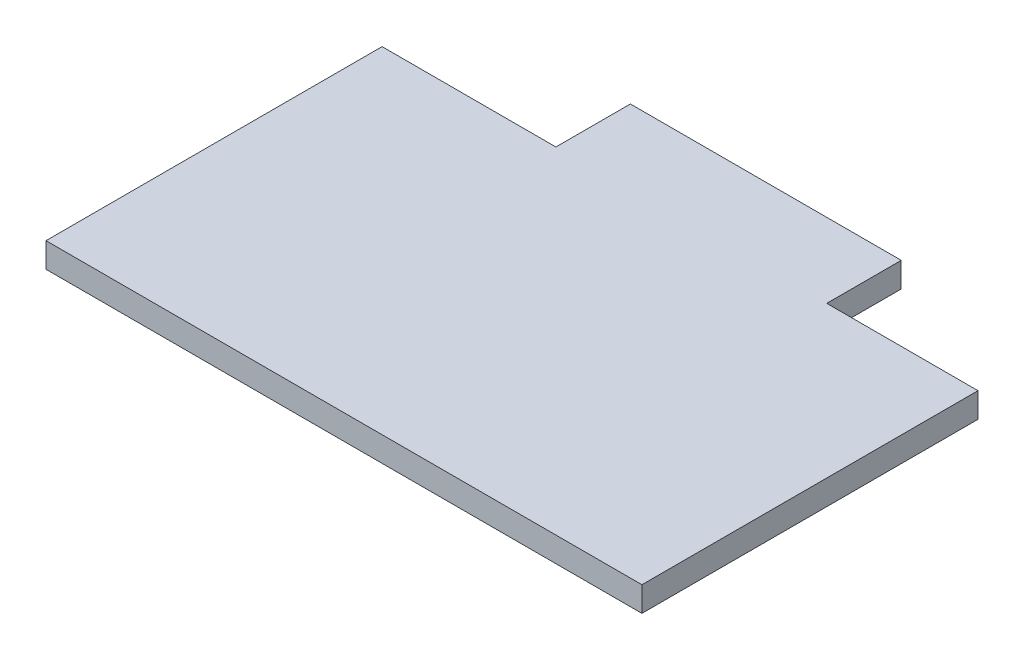
ISO-10303-21;
HEADER;
FILE_DESCRIPTION(('STEP AP214'),'2;1');
FILE_NAME('part.step','',(''),(''),'','','');
FILE_SCHEMA(('AUTOMOTIVE_DESIGN { 1 0 10303 214 1 1 1 1 }'));
ENDSEC;
DATA;
#1=APPLICATION_CONTEXT('core data for automotive mechanical design processes');
#2=APPLICATION_PROTOCOL_DEFINITION('international standard','automotive_design',2000,#1);
#3=PRODUCT_CONTEXT('',#1,'mechanical');
#4=PRODUCT('Part','Part','',(#3));
#5=PRODUCT_RELATED_PRODUCT_CATEGORY('part','',(#4));
#6=PRODUCT_DEFINITION_FORMATION('','',#4);
#7=PRODUCT_DEFINITION_CONTEXT('part definition',#1,'design');
#8=PRODUCT_DEFINITION('design','',#6,#7);
#9=PRODUCT_DEFINITION_SHAPE('','',#8);
#10=(LENGTH_UNIT() NAMED_UNIT(*) SI_UNIT(.MILLI.,.METRE.));
#11=(NAMED_UNIT(*) PLANE_ANGLE_UNIT() SI_UNIT($,.RADIAN.));
#12=(NAMED_UNIT(*) SI_UNIT($,.STERADIAN.) SOLID_ANGLE_UNIT());
#13=UNCERTAINTY_MEASURE_WITH_UNIT(LENGTH_MEASURE(1.E-05),#10,'distance_accuracy_value','');
#14=(GEOMETRIC_REPRESENTATION_CONTEXT(3) GLOBAL_UNCERTAINTY_ASSIGNED_CONTEXT((#13)) GLOBAL_UNIT_ASSIGNED_CONTEXT((#10,
#11,#12)) REPRESENTATION_CONTEXT('',''));
#15=CARTESIAN_POINT('',(0.,0.,0.));
#16=DIRECTION('',(0.,0.,1.));
#17=DIRECTION('',(1.,0.,0.));
#18=AXIS2_PLACEMENT_3D('',#15,#16,#17);
#19=CARTESIAN_POINT('',(152.4,12.7,105.));
#20=DIRECTION('',(-1.,0.,0.));
#21=DIRECTION('',(0.,0.,1.));
#22=AXIS2_PLACEMENT_3D('',#19,#20,#21);
#23=PLANE('',#22);
#24=DIRECTION('',(0.,0.,-1.));
#25=VECTOR('',#24,1.);
#26=CARTESIAN_POINT('',(152.4,0.,105.));
#27=LINE('',#26,#25);
#28=CARTESIAN_POINT('',(152.4,0.,105.));
#29=VERTEX_POINT('',#28);
#30=CARTESIAN_POINT('',(152.4,0.,-66.8999999999999));
#31=VERTEX_POINT('',#30);
#32=EDGE_CURVE('E139',#29,#31,#27,.T.);
#33=ORIENTED_EDGE('',*,*,#32,.T.);
#34=DIRECTION('',(0.,1.,0.));
#35=VECTOR('',#34,1.);
#36=CARTESIAN_POINT('',(152.4,12.7,-66.8999999999999));
#37=LINE('',#36,#35);
#38=CARTESIAN_POINT('',(152.4,12.7,-66.8999999999999));
#39=VERTEX_POINT('',#38);
#40=EDGE_CURVE('E49',#31,#39,#37,.T.);
#41=ORIENTED_EDGE('',*,*,#40,.T.);
#42=DIRECTION('',(0.,0.,-1.));
#43=VECTOR('',#42,1.);
#44=CARTESIAN_POINT('',(152.4,12.7,105.));
#45=LINE('',#44,#43);
#46=CARTESIAN_POINT('',(152.4,12.7,105.));
#47=VERTEX_POINT('',#46);
#48=EDGE_CURVE('E140',#47,#39,#45,.T.);
#49=ORIENTED_EDGE('',*,*,#48,.F.);
#50=DIRECTION('',(0.,-1.,0.));
#51=VECTOR('',#50,1.);
#52=CARTESIAN_POINT('',(152.4,12.7,105.));
#53=LINE('',#52,#51);
#54=EDGE_CURVE('E150',#47,#29,#53,.T.);
#55=ORIENTED_EDGE('',*,*,#54,.T.);
#56=EDGE_LOOP('',(#33,#41,#49,#55));
#57=FACE_BOUND('',#56,.T.);
#58=ADVANCED_FACE('F36',(#57),#23,.F.);
#59=CARTESIAN_POINT('',(-152.4,12.7,-105.));
#60=DIRECTION('',(0.,0.,1.));
#61=DIRECTION('',(1.,0.,0.));
#62=AXIS2_PLACEMENT_3D('',#59,#60,#61);
#63=PLANE('',#62);
#64=DIRECTION('',(-1.,0.,0.));
#65=VECTOR('',#64,1.);
#66=CARTESIAN_POINT('',(-152.4,12.7,-105.));
#67=LINE('',#66,#65);
#68=CARTESIAN_POINT('',(75.0369338420033,12.7,-105.));
#69=VERTEX_POINT('',#68);
#70=CARTESIAN_POINT('',(-63.5,12.7,-105.));
#71=VERTEX_POINT('',#70);
#72=EDGE_CURVE('E143',#69,#71,#67,.T.);
#73=ORIENTED_EDGE('',*,*,#72,.F.);
#74=DIRECTION('',(0.,-1.,0.));
#75=VECTOR('',#74,1.);
#76=CARTESIAN_POINT('',(75.0369338420033,12.7,-105.));
#77=LINE('',#76,#75);
#78=CARTESIAN_POINT('',(75.0369338420033,0.,-105.));
#79=VERTEX_POINT('',#78);
#80=EDGE_CURVE('E122',#69,#79,#77,.T.);
#81=ORIENTED_EDGE('',*,*,#80,.T.);
#82=DIRECTION('',(-1.,0.,0.));
#83=VECTOR('',#82,1.);
#84=CARTESIAN_POINT('',(-152.4,0.,-105.));
#85=LINE('',#84,#83);
#86=CARTESIAN_POINT('',(-63.5,0.,-105.));
#87=VERTEX_POINT('',#86);
#88=EDGE_CURVE('E116',#79,#87,#85,.T.);
#89=ORIENTED_EDGE('',*,*,#88,.T.);
#90=DIRECTION('',(0.,1.,0.));
#91=VECTOR('',#90,1.);
#92=CARTESIAN_POINT('',(-63.5,12.7,-105.));
#93=LINE('',#92,#91);
#94=EDGE_CURVE('E136',#87,#71,#93,.T.);
#95=ORIENTED_EDGE('',*,*,#94,.T.);
#96=EDGE_LOOP('',(#73,#81,#89,#95));
#97=FACE_BOUND('',#96,.T.);
#98=ADVANCED_FACE('F178',(#97),#63,.F.);
#99=CARTESIAN_POINT('',(-152.4,12.7,105.));
#100=DIRECTION('',(1.,0.,0.));
#101=DIRECTION('',(0.,0.,-1.));
#102=AXIS2_PLACEMENT_3D('',#99,#100,#101);
#103=PLANE('',#102);
#104=DIRECTION('',(0.,0.,1.));
#105=VECTOR('',#104,1.);
#106=CARTESIAN_POINT('',(-152.4,12.7,105.));
#107=LINE('',#106,#105);
#108=CARTESIAN_POINT('',(-152.4,12.7,-66.9));
#109=VERTEX_POINT('',#108);
#110=CARTESIAN_POINT('',(-152.4,12.7,105.));
#111=VERTEX_POINT('',#110);
#112=EDGE_CURVE('E146',#109,#111,#107,.T.);
#113=ORIENTED_EDGE('',*,*,#112,.F.);
#114=DIRECTION('',(0.,-1.,0.));
#115=VECTOR('',#114,1.);
#116=CARTESIAN_POINT('',(-152.4,12.7,-66.9));
#117=LINE('',#116,#115);
#118=CARTESIAN_POINT('',(-152.4,0.,-66.9));
#119=VERTEX_POINT('',#118);
#120=EDGE_CURVE('E130',#109,#119,#117,.T.);
#121=ORIENTED_EDGE('',*,*,#120,.T.);
#122=DIRECTION('',(0.,0.,1.));
#123=VECTOR('',#122,1.);
#124=CARTESIAN_POINT('',(-152.4,0.,105.));
#125=LINE('',#124,#123);
#126=CARTESIAN_POINT('',(-152.4,0.,105.));
#127=VERTEX_POINT('',#126);
#128=EDGE_CURVE('E153',#119,#127,#125,.T.);
#129=ORIENTED_EDGE('',*,*,#128,.T.);
#130=DIRECTION('',(0.,-1.,0.));
#131=VECTOR('',#130,1.);
#132=CARTESIAN_POINT('',(-152.4,12.7,105.));
#133=LINE('',#132,#131);
#134=EDGE_CURVE('E158',#111,#127,#133,.T.);
#135=ORIENTED_EDGE('',*,*,#134,.F.);
#136=EDGE_LOOP('',(#113,#121,#129,#135));
#137=FACE_BOUND('',#136,.T.);
#138=ADVANCED_FACE('F170',(#137),#103,.F.);
#139=CARTESIAN_POINT('',(-152.4,12.7,105.));
#140=DIRECTION('',(0.,0.,-1.));
#141=DIRECTION('',(-1.,0.,0.));
#142=AXIS2_PLACEMENT_3D('',#139,#140,#141);
#143=PLANE('',#142);
#144=DIRECTION('',(1.,0.,0.));
#145=VECTOR('',#144,1.);
#146=CARTESIAN_POINT('',(-152.4,0.,105.));
#147=LINE('',#146,#145);
#148=EDGE_CURVE('E144',#127,#29,#147,.T.);
#149=ORIENTED_EDGE('',*,*,#148,.T.);
#150=ORIENTED_EDGE('',*,*,#54,.F.);
#151=DIRECTION('',(1.,0.,0.));
#152=VECTOR('',#151,1.);
#153=CARTESIAN_POINT('',(-152.4,12.7,105.));
#154=LINE('',#153,#152);
#155=EDGE_CURVE('E148',#111,#47,#154,.T.);
#156=ORIENTED_EDGE('',*,*,#155,.F.);
#157=ORIENTED_EDGE('',*,*,#134,.T.);
#158=EDGE_LOOP('',(#149,#150,#156,#157));
#159=FACE_BOUND('',#158,.T.);
#160=ADVANCED_FACE('F182',(#159),#143,.F.);
#161=CARTESIAN_POINT('',(0.,12.7,0.));
#162=DIRECTION('',(0.,-1.,0.));
#163=DIRECTION('',(0.,0.,-1.));
#164=AXIS2_PLACEMENT_3D('',#161,#162,#163);
#165=PLANE('',#164);
#166=DIRECTION('',(-1.,0.,0.));
#167=VECTOR('',#166,1.);
#168=CARTESIAN_POINT('',(0.,12.7,-66.8999999999999));
#169=LINE('',#168,#167);
#170=CARTESIAN_POINT('',(75.0369338420033,12.7,-66.8999999999999));
#171=VERTEX_POINT('',#170);
#172=EDGE_CURVE('E107',#39,#171,#169,.T.);
#173=ORIENTED_EDGE('',*,*,#172,.T.);
#174=DIRECTION('',(0.,0.,-1.));
#175=VECTOR('',#174,1.);
#176=CARTESIAN_POINT('',(75.0369338420033,12.7,0.));
#177=LINE('',#176,#175);
#178=EDGE_CURVE('E105',#171,#69,#177,.T.);
#179=ORIENTED_EDGE('',*,*,#178,.T.);
#180=ORIENTED_EDGE('',*,*,#72,.T.);
#181=DIRECTION('',(0.,0.,1.));
#182=VECTOR('',#181,1.);
#183=CARTESIAN_POINT('',(-63.5,12.7,0.));
#184=LINE('',#183,#182);
#185=CARTESIAN_POINT('',(-63.5,12.7,-66.9));
#186=VERTEX_POINT('',#185);
#187=EDGE_CURVE('E133',#71,#186,#184,.T.);
#188=ORIENTED_EDGE('',*,*,#187,.T.);
#189=DIRECTION('',(-1.,0.,0.));
#190=VECTOR('',#189,1.);
#191=CARTESIAN_POINT('',(0.,12.7,-66.8999999999999));
#192=LINE('',#191,#190);
#193=EDGE_CURVE('E127',#186,#109,#192,.T.);
#194=ORIENTED_EDGE('',*,*,#193,.T.);
#195=ORIENTED_EDGE('',*,*,#112,.T.);
#196=ORIENTED_EDGE('',*,*,#155,.T.);
#197=ORIENTED_EDGE('',*,*,#48,.T.);
#198=EDGE_LOOP('',(#173,#179,#180,#188,#194,#195,#196,#197));
#199=FACE_BOUND('',#198,.T.);
#200=ADVANCED_FACE('F174',(#199),#165,.F.);
#201=CARTESIAN_POINT('',(0.,0.,0.));
#202=DIRECTION('',(0.,-1.,0.));
#203=DIRECTION('',(0.,0.,-1.));
#204=AXIS2_PLACEMENT_3D('',#201,#202,#203);
#205=PLANE('',#204);
#206=DIRECTION('',(0.,0.,-1.));
#207=VECTOR('',#206,1.);
#208=CARTESIAN_POINT('',(75.0369338420033,0.,-142.304069630941));
#209=LINE('',#208,#207);
#210=CARTESIAN_POINT('',(75.0369338420033,0.,-66.8999999999999));
#211=VERTEX_POINT('',#210);
#212=EDGE_CURVE('E102',#211,#79,#209,.T.);
#213=ORIENTED_EDGE('',*,*,#212,.F.);
#214=DIRECTION('',(-1.,0.,0.));
#215=VECTOR('',#214,1.);
#216=CARTESIAN_POINT('',(0.,0.,-66.8999999999999));
#217=LINE('',#216,#215);
#218=EDGE_CURVE('E12',#31,#211,#217,.T.);
#219=ORIENTED_EDGE('',*,*,#218,.F.);
#220=ORIENTED_EDGE('',*,*,#32,.F.);
#221=ORIENTED_EDGE('',*,*,#148,.F.);
#222=ORIENTED_EDGE('',*,*,#128,.F.);
#223=DIRECTION('',(-1.,0.,0.));
#224=VECTOR('',#223,1.);
#225=CARTESIAN_POINT('',(-63.5,0.,-66.9));
#226=LINE('',#225,#224);
#227=CARTESIAN_POINT('',(-63.5,0.,-66.9));
#228=VERTEX_POINT('',#227);
#229=EDGE_CURVE('E124',#228,#119,#226,.T.);
#230=ORIENTED_EDGE('',*,*,#229,.F.);
#231=DIRECTION('',(0.,0.,1.));
#232=VECTOR('',#231,1.);
#233=CARTESIAN_POINT('',(-63.5,0.,0.));
#234=LINE('',#233,#232);
#235=EDGE_CURVE('E43',#87,#228,#234,.T.);
#236=ORIENTED_EDGE('',*,*,#235,.F.);
#237=ORIENTED_EDGE('',*,*,#88,.F.);
#238=EDGE_LOOP('',(#213,#219,#220,#221,#222,#230,#236,#237));
#239=FACE_BOUND('',#238,.T.);
#240=ADVANCED_FACE('F114',(#239),#205,.T.);
#241=CARTESIAN_POINT('',(-63.5,121.,-66.9));
#242=DIRECTION('',(1.,0.,0.));
#243=DIRECTION('',(0.,0.,-1.));
#244=AXIS2_PLACEMENT_3D('',#241,#242,#243);
#245=PLANE('',#244);
#246=ORIENTED_EDGE('',*,*,#235,.T.);
#247=DIRECTION('',(0.,-1.,0.));
#248=VECTOR('',#247,1.);
#249=CARTESIAN_POINT('',(-63.5,121.,-66.9));
#250=LINE('',#249,#248);
#251=EDGE_CURVE('E57',#186,#228,#250,.T.);
#252=ORIENTED_EDGE('',*,*,#251,.F.);
#253=ORIENTED_EDGE('',*,*,#187,.F.);
#254=ORIENTED_EDGE('',*,*,#94,.F.);
#255=EDGE_LOOP('',(#246,#252,#253,#254));
#256=FACE_BOUND('',#255,.T.);
#257=ADVANCED_FACE('F163',(#256),#245,.F.);
#258=CARTESIAN_POINT('',(-63.5,121.,-66.9));
#259=DIRECTION('',(0.,0.,1.));
#260=DIRECTION('',(1.,0.,0.));
#261=AXIS2_PLACEMENT_3D('',#258,#259,#260);
#262=PLANE('',#261);
#263=ORIENTED_EDGE('',*,*,#193,.F.);
#264=ORIENTED_EDGE('',*,*,#251,.T.);
#265=ORIENTED_EDGE('',*,*,#229,.T.);
#266=ORIENTED_EDGE('',*,*,#120,.F.);
#267=EDGE_LOOP('',(#263,#264,#265,#266));
#268=FACE_BOUND('',#267,.T.);
#269=ADVANCED_FACE('F167',(#268),#262,.F.);
#270=CARTESIAN_POINT('',(75.0369338420033,121.,-142.304069630941));
#271=DIRECTION('',(-1.,0.,0.));
#272=DIRECTION('',(0.,0.,1.));
#273=AXIS2_PLACEMENT_3D('',#270,#271,#272);
#274=PLANE('',#273);
#275=ORIENTED_EDGE('',*,*,#178,.F.);
#276=DIRECTION('',(0.,-1.,0.));
#277=VECTOR('',#276,1.);
#278=CARTESIAN_POINT('',(75.0369338420033,121.,-66.8999999999999));
#279=LINE('',#278,#277);
#280=EDGE_CURVE('E99',#171,#211,#279,.T.);
#281=ORIENTED_EDGE('',*,*,#280,.T.);
#282=ORIENTED_EDGE('',*,*,#212,.T.);
#283=ORIENTED_EDGE('',*,*,#80,.F.);
#284=EDGE_LOOP('',(#275,#281,#282,#283));
#285=FACE_BOUND('',#284,.T.);
#286=ADVANCED_FACE('F100',(#285),#274,.F.);
#287=CARTESIAN_POINT('',(75.0369338420033,121.,-66.8999999999999));
#288=DIRECTION('',(0.,0.,1.));
#289=DIRECTION('',(1.,0.,0.));
#290=AXIS2_PLACEMENT_3D('',#287,#288,#289);
#291=PLANE('',#290);
#292=ORIENTED_EDGE('',*,*,#218,.T.);
#293=ORIENTED_EDGE('',*,*,#280,.F.);
#294=ORIENTED_EDGE('',*,*,#172,.F.);
#295=ORIENTED_EDGE('',*,*,#40,.F.);
#296=EDGE_LOOP('',(#292,#293,#294,#295));
#297=FACE_BOUND('',#296,.T.);
#298=ADVANCED_FACE('F109',(#297),#291,.F.);
#299=CLOSED_SHELL('',(#58,#98,#138,#160,#200,#240,#257,#269,#286,#298));
#300=MANIFOLD_SOLID_BREP('B2',#299);
#301=ADVANCED_BREP_SHAPE_REPRESENTATION('',(#18,#300),#14);
#302=SHAPE_DEFINITION_REPRESENTATION(#9,#301);
ENDSEC;
END-ISO-10303-21;
